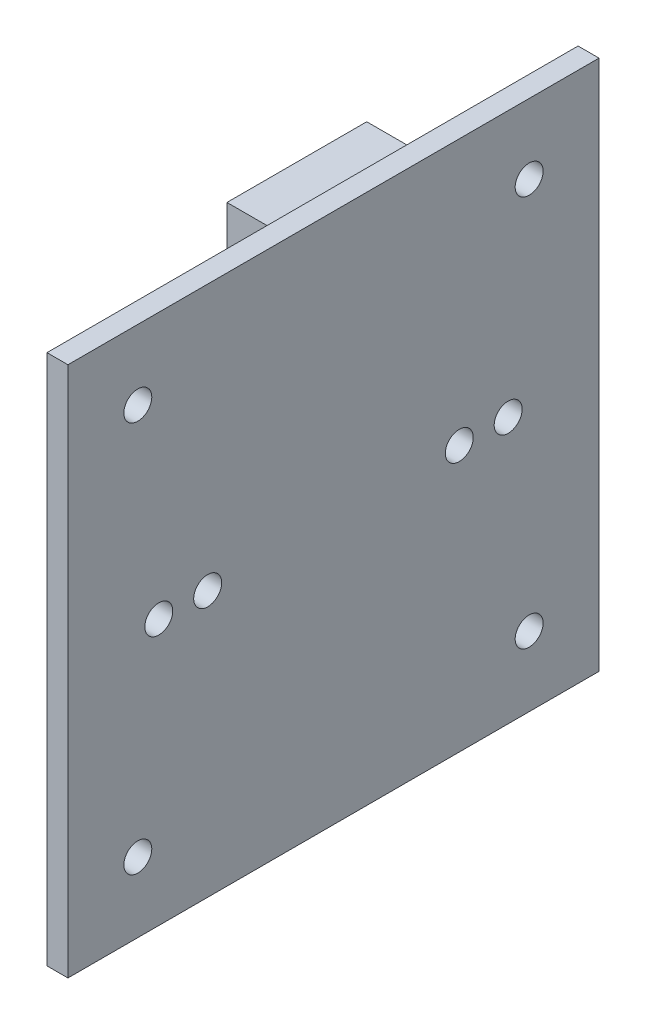
ISO-10303-21;
HEADER;
FILE_DESCRIPTION(('STEP AP214'),'2;1');
FILE_NAME('part.step','',(''),(''),'','','');
FILE_SCHEMA(('AUTOMOTIVE_DESIGN { 1 0 10303 214 1 1 1 1 }'));
ENDSEC;
DATA;
#1=APPLICATION_CONTEXT('core data for automotive mechanical design processes');
#2=APPLICATION_PROTOCOL_DEFINITION('international standard','automotive_design',2000,#1);
#3=PRODUCT_CONTEXT('',#1,'mechanical');
#4=PRODUCT('Part','Part','',(#3));
#5=PRODUCT_RELATED_PRODUCT_CATEGORY('part','',(#4));
#6=PRODUCT_DEFINITION_FORMATION('','',#4);
#7=PRODUCT_DEFINITION_CONTEXT('part definition',#1,'design');
#8=PRODUCT_DEFINITION('design','',#6,#7);
#9=PRODUCT_DEFINITION_SHAPE('','',#8);
#10=(LENGTH_UNIT() NAMED_UNIT(*) SI_UNIT(.MILLI.,.METRE.));
#11=(NAMED_UNIT(*) PLANE_ANGLE_UNIT() SI_UNIT($,.RADIAN.));
#12=(NAMED_UNIT(*) SI_UNIT($,.STERADIAN.) SOLID_ANGLE_UNIT());
#13=UNCERTAINTY_MEASURE_WITH_UNIT(LENGTH_MEASURE(1.E-05),#10,'distance_accuracy_value','');
#14=(GEOMETRIC_REPRESENTATION_CONTEXT(3) GLOBAL_UNCERTAINTY_ASSIGNED_CONTEXT((#13)) GLOBAL_UNIT_ASSIGNED_CONTEXT((#10,
#11,#12)) REPRESENTATION_CONTEXT('',''));
#15=CARTESIAN_POINT('',(0.,0.,0.));
#16=DIRECTION('',(0.,0.,1.));
#17=DIRECTION('',(1.,0.,0.));
#18=AXIS2_PLACEMENT_3D('',#15,#16,#17);
#19=CARTESIAN_POINT('',(0.,0.,0.));
#20=DIRECTION('',(-1.,0.,0.));
#21=DIRECTION('',(0.,0.,1.));
#22=AXIS2_PLACEMENT_3D('',#19,#20,#21);
#23=PLANE('',#22);
#24=CARTESIAN_POINT('',(0.,0.,9.));
#25=DIRECTION('',(-1.,0.,0.));
#26=DIRECTION('',(0.,0.,1.));
#27=AXIS2_PLACEMENT_3D('',#24,#25,#26);
#28=CIRCLE('',#27,1.);
#29=CARTESIAN_POINT('',(0.,0.,10.));
#30=VERTEX_POINT('',#29);
#31=EDGE_CURVE('E157',#30,#30,#28,.T.);
#32=ORIENTED_EDGE('',*,*,#31,.F.);
#33=EDGE_LOOP('',(#32));
#34=FACE_BOUND('',#33,.T.);
#35=CARTESIAN_POINT('',(0.,0.,-9.));
#36=DIRECTION('',(-1.,0.,0.));
#37=DIRECTION('',(0.,0.,1.));
#38=AXIS2_PLACEMENT_3D('',#35,#36,#37);
#39=CIRCLE('',#38,1.);
#40=CARTESIAN_POINT('',(0.,0.,-8.));
#41=VERTEX_POINT('',#40);
#42=EDGE_CURVE('E545',#41,#41,#39,.T.);
#43=ORIENTED_EDGE('',*,*,#42,.F.);
#44=EDGE_LOOP('',(#43));
#45=FACE_BOUND('',#44,.T.);
#46=CARTESIAN_POINT('',(0.,-14.,14.));
#47=DIRECTION('',(1.,0.,0.));
#48=DIRECTION('',(0.,0.,-1.));
#49=AXIS2_PLACEMENT_3D('',#46,#47,#48);
#50=CIRCLE('',#49,0.999999999999999);
#51=CARTESIAN_POINT('',(0.,-14.,13.));
#52=VERTEX_POINT('',#51);
#53=EDGE_CURVE('E229',#52,#52,#50,.T.);
#54=ORIENTED_EDGE('',*,*,#53,.T.);
#55=EDGE_LOOP('',(#54));
#56=FACE_BOUND('',#55,.T.);
#57=CARTESIAN_POINT('',(0.,-14.,-14.));
#58=DIRECTION('',(1.,0.,0.));
#59=DIRECTION('',(0.,0.,-1.));
#60=AXIS2_PLACEMENT_3D('',#57,#58,#59);
#61=CIRCLE('',#60,0.999999999999999);
#62=CARTESIAN_POINT('',(0.,-14.,-15.));
#63=VERTEX_POINT('',#62);
#64=EDGE_CURVE('E238',#63,#63,#61,.T.);
#65=ORIENTED_EDGE('',*,*,#64,.T.);
#66=EDGE_LOOP('',(#65));
#67=FACE_BOUND('',#66,.T.);
#68=CARTESIAN_POINT('',(0.,14.,-14.));
#69=DIRECTION('',(1.,0.,0.));
#70=DIRECTION('',(0.,0.,-1.));
#71=AXIS2_PLACEMENT_3D('',#68,#69,#70);
#72=CIRCLE('',#71,0.999999999999999);
#73=CARTESIAN_POINT('',(0.,14.,-15.));
#74=VERTEX_POINT('',#73);
#75=EDGE_CURVE('E246',#74,#74,#72,.T.);
#76=ORIENTED_EDGE('',*,*,#75,.T.);
#77=EDGE_LOOP('',(#76));
#78=FACE_BOUND('',#77,.T.);
#79=CARTESIAN_POINT('',(0.,0.,12.5));
#80=DIRECTION('',(1.,0.,0.));
#81=DIRECTION('',(0.,0.,-1.));
#82=AXIS2_PLACEMENT_3D('',#79,#80,#81);
#83=CIRCLE('',#82,1.);
#84=CARTESIAN_POINT('',(0.,0.,11.5));
#85=VERTEX_POINT('',#84);
#86=EDGE_CURVE('E254',#85,#85,#83,.T.);
#87=ORIENTED_EDGE('',*,*,#86,.T.);
#88=EDGE_LOOP('',(#87));
#89=FACE_BOUND('',#88,.T.);
#90=CARTESIAN_POINT('',(0.,0.,-12.5));
#91=DIRECTION('',(1.,0.,0.));
#92=DIRECTION('',(0.,0.,-1.));
#93=AXIS2_PLACEMENT_3D('',#90,#91,#92);
#94=CIRCLE('',#93,1.);
#95=CARTESIAN_POINT('',(0.,0.,-13.5));
#96=VERTEX_POINT('',#95);
#97=EDGE_CURVE('E221',#96,#96,#94,.T.);
#98=ORIENTED_EDGE('',*,*,#97,.T.);
#99=EDGE_LOOP('',(#98));
#100=FACE_BOUND('',#99,.T.);
#101=CARTESIAN_POINT('',(0.,14.,14.));
#102=DIRECTION('',(1.,0.,0.));
#103=DIRECTION('',(0.,0.,-1.));
#104=AXIS2_PLACEMENT_3D('',#101,#102,#103);
#105=CIRCLE('',#104,0.999999999999999);
#106=CARTESIAN_POINT('',(0.,14.,13.));
#107=VERTEX_POINT('',#106);
#108=EDGE_CURVE('E261',#107,#107,#105,.T.);
#109=ORIENTED_EDGE('',*,*,#108,.T.);
#110=EDGE_LOOP('',(#109));
#111=FACE_BOUND('',#110,.T.);
#112=DIRECTION('',(0.,0.,-1.));
#113=VECTOR('',#112,1.);
#114=CARTESIAN_POINT('',(0.,-19.,19.));
#115=LINE('',#114,#113);
#116=CARTESIAN_POINT('',(0.,-19.,19.));
#117=VERTEX_POINT('',#116);
#118=CARTESIAN_POINT('',(0.,-19.,-19.));
#119=VERTEX_POINT('',#118);
#120=EDGE_CURVE('E265',#117,#119,#115,.T.);
#121=ORIENTED_EDGE('',*,*,#120,.F.);
#122=DIRECTION('',(0.,-1.,0.));
#123=VECTOR('',#122,1.);
#124=CARTESIAN_POINT('',(0.,19.,19.));
#125=LINE('',#124,#123);
#126=CARTESIAN_POINT('',(0.,19.,19.));
#127=VERTEX_POINT('',#126);
#128=EDGE_CURVE('E273',#127,#117,#125,.T.);
#129=ORIENTED_EDGE('',*,*,#128,.F.);
#130=DIRECTION('',(0.,0.,-1.));
#131=VECTOR('',#130,1.);
#132=CARTESIAN_POINT('',(0.,19.,19.));
#133=LINE('',#132,#131);
#134=CARTESIAN_POINT('',(0.,19.,-19.));
#135=VERTEX_POINT('',#134);
#136=EDGE_CURVE('E292',#127,#135,#133,.T.);
#137=ORIENTED_EDGE('',*,*,#136,.T.);
#138=DIRECTION('',(0.,-1.,0.));
#139=VECTOR('',#138,1.);
#140=CARTESIAN_POINT('',(0.,19.,-19.));
#141=LINE('',#140,#139);
#142=EDGE_CURVE('E288',#135,#119,#141,.T.);
#143=ORIENTED_EDGE('',*,*,#142,.T.);
#144=EDGE_LOOP('',(#121,#129,#137,#143));
#145=FACE_BOUND('',#144,.T.);
#146=DIRECTION('',(0.,-1.,0.));
#147=VECTOR('',#146,1.);
#148=CARTESIAN_POINT('',(0.,14.8675526556487,-0.878697065108815));
#149=LINE('',#148,#147);
#150=CARTESIAN_POINT('',(0.,14.8675526556487,-0.878697065108815));
#151=VERTEX_POINT('',#150);
#152=CARTESIAN_POINT('',(0.,10.8675526556487,-0.878697065108815));
#153=VERTEX_POINT('',#152);
#154=EDGE_CURVE('E200',#151,#153,#149,.T.);
#155=ORIENTED_EDGE('',*,*,#154,.T.);
#156=DIRECTION('',(0.,0.,1.));
#157=VECTOR('',#156,1.);
#158=CARTESIAN_POINT('',(0.,10.8675526556487,-10.8786970651088));
#159=LINE('',#158,#157);
#160=CARTESIAN_POINT('',(0.,10.8675526556487,-10.8786970651088));
#161=VERTEX_POINT('',#160);
#162=EDGE_CURVE('E175',#161,#153,#159,.T.);
#163=ORIENTED_EDGE('',*,*,#162,.F.);
#164=DIRECTION('',(0.,-1.,0.));
#165=VECTOR('',#164,1.);
#166=CARTESIAN_POINT('',(0.,14.8675526556487,-10.8786970651088));
#167=LINE('',#166,#165);
#168=CARTESIAN_POINT('',(0.,14.8675526556487,-10.8786970651088));
#169=VERTEX_POINT('',#168);
#170=EDGE_CURVE('E185',#169,#161,#167,.T.);
#171=ORIENTED_EDGE('',*,*,#170,.F.);
#172=DIRECTION('',(0.,0.,1.));
#173=VECTOR('',#172,1.);
#174=CARTESIAN_POINT('',(0.,14.8675526556487,-10.8786970651088));
#175=LINE('',#174,#173);
#176=EDGE_CURVE('E62',#169,#151,#175,.T.);
#177=ORIENTED_EDGE('',*,*,#176,.T.);
#178=EDGE_LOOP('',(#155,#163,#171,#177));
#179=FACE_BOUND('',#178,.T.);
#180=ADVANCED_FACE('F38',(#34,#45,#56,#67,#78,#89,#100,#111,#145,#179),#23,.T.);
#181=CARTESIAN_POINT('',(1.5,-19.,19.));
#182=DIRECTION('',(0.,1.,0.));
#183=DIRECTION('',(0.,0.,1.));
#184=AXIS2_PLACEMENT_3D('',#181,#182,#183);
#185=PLANE('',#184);
#186=ORIENTED_EDGE('',*,*,#120,.T.);
#187=DIRECTION('',(-1.,0.,0.));
#188=VECTOR('',#187,1.);
#189=CARTESIAN_POINT('',(1.5,-19.,-19.));
#190=LINE('',#189,#188);
#191=CARTESIAN_POINT('',(1.5,-19.,-19.));
#192=VERTEX_POINT('',#191);
#193=EDGE_CURVE('E11',#192,#119,#190,.T.);
#194=ORIENTED_EDGE('',*,*,#193,.F.);
#195=DIRECTION('',(0.,0.,-1.));
#196=VECTOR('',#195,1.);
#197=CARTESIAN_POINT('',(1.5,-19.,19.));
#198=LINE('',#197,#196);
#199=CARTESIAN_POINT('',(1.5,-19.,19.));
#200=VERTEX_POINT('',#199);
#201=EDGE_CURVE('E269',#200,#192,#198,.T.);
#202=ORIENTED_EDGE('',*,*,#201,.F.);
#203=DIRECTION('',(-1.,0.,0.));
#204=VECTOR('',#203,1.);
#205=CARTESIAN_POINT('',(1.5,-19.,19.));
#206=LINE('',#205,#204);
#207=EDGE_CURVE('E284',#200,#117,#206,.T.);
#208=ORIENTED_EDGE('',*,*,#207,.T.);
#209=EDGE_LOOP('',(#186,#194,#202,#208));
#210=FACE_BOUND('',#209,.T.);
#211=ADVANCED_FACE('F40',(#210),#185,.F.);
#212=CARTESIAN_POINT('',(1.5,19.,-19.));
#213=DIRECTION('',(0.,0.,-1.));
#214=DIRECTION('',(0.,1.,0.));
#215=AXIS2_PLACEMENT_3D('',#212,#213,#214);
#216=PLANE('',#215);
#217=ORIENTED_EDGE('',*,*,#142,.F.);
#218=DIRECTION('',(-1.,0.,0.));
#219=VECTOR('',#218,1.);
#220=CARTESIAN_POINT('',(1.5,19.,-19.));
#221=LINE('',#220,#219);
#222=CARTESIAN_POINT('',(1.5,19.,-19.));
#223=VERTEX_POINT('',#222);
#224=EDGE_CURVE('E47',#223,#135,#221,.T.);
#225=ORIENTED_EDGE('',*,*,#224,.F.);
#226=DIRECTION('',(0.,-1.,0.));
#227=VECTOR('',#226,1.);
#228=CARTESIAN_POINT('',(1.5,19.,-19.));
#229=LINE('',#228,#227);
#230=EDGE_CURVE('E272',#223,#192,#229,.T.);
#231=ORIENTED_EDGE('',*,*,#230,.T.);
#232=ORIENTED_EDGE('',*,*,#193,.T.);
#233=EDGE_LOOP('',(#217,#225,#231,#232));
#234=FACE_BOUND('',#233,.T.);
#235=ADVANCED_FACE('F311',(#234),#216,.T.);
#236=CARTESIAN_POINT('',(1.5,19.,19.));
#237=DIRECTION('',(0.,1.,0.));
#238=DIRECTION('',(0.,0.,1.));
#239=AXIS2_PLACEMENT_3D('',#236,#237,#238);
#240=PLANE('',#239);
#241=ORIENTED_EDGE('',*,*,#136,.F.);
#242=DIRECTION('',(-1.,0.,0.));
#243=VECTOR('',#242,1.);
#244=CARTESIAN_POINT('',(1.5,19.,19.));
#245=LINE('',#244,#243);
#246=CARTESIAN_POINT('',(1.5,19.,19.));
#247=VERTEX_POINT('',#246);
#248=EDGE_CURVE('E301',#247,#127,#245,.T.);
#249=ORIENTED_EDGE('',*,*,#248,.F.);
#250=DIRECTION('',(0.,0.,-1.));
#251=VECTOR('',#250,1.);
#252=CARTESIAN_POINT('',(1.5,19.,19.));
#253=LINE('',#252,#251);
#254=EDGE_CURVE('E277',#247,#223,#253,.T.);
#255=ORIENTED_EDGE('',*,*,#254,.T.);
#256=ORIENTED_EDGE('',*,*,#224,.T.);
#257=EDGE_LOOP('',(#241,#249,#255,#256));
#258=FACE_BOUND('',#257,.T.);
#259=ADVANCED_FACE('F307',(#258),#240,.T.);
#260=CARTESIAN_POINT('',(1.5,19.,19.));
#261=DIRECTION('',(0.,0.,-1.));
#262=DIRECTION('',(0.,1.,0.));
#263=AXIS2_PLACEMENT_3D('',#260,#261,#262);
#264=PLANE('',#263);
#265=ORIENTED_EDGE('',*,*,#128,.T.);
#266=ORIENTED_EDGE('',*,*,#207,.F.);
#267=DIRECTION('',(0.,-1.,0.));
#268=VECTOR('',#267,1.);
#269=CARTESIAN_POINT('',(1.5,19.,19.));
#270=LINE('',#269,#268);
#271=EDGE_CURVE('E281',#247,#200,#270,.T.);
#272=ORIENTED_EDGE('',*,*,#271,.F.);
#273=ORIENTED_EDGE('',*,*,#248,.T.);
#274=EDGE_LOOP('',(#265,#266,#272,#273));
#275=FACE_BOUND('',#274,.T.);
#276=ADVANCED_FACE('F319',(#275),#264,.F.);
#277=CARTESIAN_POINT('',(1.5,0.,0.));
#278=DIRECTION('',(-1.,0.,0.));
#279=DIRECTION('',(0.,0.,1.));
#280=AXIS2_PLACEMENT_3D('',#277,#278,#279);
#281=PLANE('',#280);
#282=CARTESIAN_POINT('',(1.5,0.,9.));
#283=DIRECTION('',(1.,0.,0.));
#284=DIRECTION('',(0.,0.,-1.));
#285=AXIS2_PLACEMENT_3D('',#282,#283,#284);
#286=CIRCLE('',#285,1.);
#287=CARTESIAN_POINT('',(1.5,0.,8.));
#288=VERTEX_POINT('',#287);
#289=EDGE_CURVE('E543',#288,#288,#286,.T.);
#290=ORIENTED_EDGE('',*,*,#289,.F.);
#291=EDGE_LOOP('',(#290));
#292=FACE_BOUND('',#291,.T.);
#293=CARTESIAN_POINT('',(1.5,0.,-9.));
#294=DIRECTION('',(1.,0.,0.));
#295=DIRECTION('',(0.,0.,-1.));
#296=AXIS2_PLACEMENT_3D('',#293,#294,#295);
#297=CIRCLE('',#296,1.);
#298=CARTESIAN_POINT('',(1.5,0.,-10.));
#299=VERTEX_POINT('',#298);
#300=EDGE_CURVE('E546',#299,#299,#297,.T.);
#301=ORIENTED_EDGE('',*,*,#300,.F.);
#302=EDGE_LOOP('',(#301));
#303=FACE_BOUND('',#302,.T.);
#304=CARTESIAN_POINT('',(1.5,-14.,14.));
#305=DIRECTION('',(1.,0.,0.));
#306=DIRECTION('',(0.,0.,-1.));
#307=AXIS2_PLACEMENT_3D('',#304,#305,#306);
#308=CIRCLE('',#307,0.999999999999999);
#309=CARTESIAN_POINT('',(1.5,-14.,13.));
#310=VERTEX_POINT('',#309);
#311=EDGE_CURVE('E234',#310,#310,#308,.T.);
#312=ORIENTED_EDGE('',*,*,#311,.F.);
#313=EDGE_LOOP('',(#312));
#314=FACE_BOUND('',#313,.T.);
#315=CARTESIAN_POINT('',(1.5,-14.,-14.));
#316=DIRECTION('',(1.,0.,0.));
#317=DIRECTION('',(0.,0.,-1.));
#318=AXIS2_PLACEMENT_3D('',#315,#316,#317);
#319=CIRCLE('',#318,0.999999999999999);
#320=CARTESIAN_POINT('',(1.5,-14.,-15.));
#321=VERTEX_POINT('',#320);
#322=EDGE_CURVE('E242',#321,#321,#319,.T.);
#323=ORIENTED_EDGE('',*,*,#322,.F.);
#324=EDGE_LOOP('',(#323));
#325=FACE_BOUND('',#324,.T.);
#326=CARTESIAN_POINT('',(1.5,14.,-14.));
#327=DIRECTION('',(1.,0.,0.));
#328=DIRECTION('',(0.,0.,-1.));
#329=AXIS2_PLACEMENT_3D('',#326,#327,#328);
#330=CIRCLE('',#329,0.999999999999999);
#331=CARTESIAN_POINT('',(1.5,14.,-15.));
#332=VERTEX_POINT('',#331);
#333=EDGE_CURVE('E250',#332,#332,#330,.T.);
#334=ORIENTED_EDGE('',*,*,#333,.F.);
#335=EDGE_LOOP('',(#334));
#336=FACE_BOUND('',#335,.T.);
#337=CARTESIAN_POINT('',(1.5,0.,12.5));
#338=DIRECTION('',(1.,0.,0.));
#339=DIRECTION('',(0.,0.,-1.));
#340=AXIS2_PLACEMENT_3D('',#337,#338,#339);
#341=CIRCLE('',#340,1.);
#342=CARTESIAN_POINT('',(1.5,0.,11.5));
#343=VERTEX_POINT('',#342);
#344=EDGE_CURVE('E225',#343,#343,#341,.T.);
#345=ORIENTED_EDGE('',*,*,#344,.F.);
#346=EDGE_LOOP('',(#345));
#347=FACE_BOUND('',#346,.T.);
#348=CARTESIAN_POINT('',(1.5,0.,-12.5));
#349=DIRECTION('',(1.,0.,0.));
#350=DIRECTION('',(0.,0.,-1.));
#351=AXIS2_PLACEMENT_3D('',#348,#349,#350);
#352=CIRCLE('',#351,1.);
#353=CARTESIAN_POINT('',(1.5,0.,-13.5));
#354=VERTEX_POINT('',#353);
#355=EDGE_CURVE('E220',#354,#354,#352,.T.);
#356=ORIENTED_EDGE('',*,*,#355,.F.);
#357=EDGE_LOOP('',(#356));
#358=FACE_BOUND('',#357,.T.);
#359=CARTESIAN_POINT('',(1.5,14.,14.));
#360=DIRECTION('',(1.,0.,0.));
#361=DIRECTION('',(0.,0.,-1.));
#362=AXIS2_PLACEMENT_3D('',#359,#360,#361);
#363=CIRCLE('',#362,0.999999999999999);
#364=CARTESIAN_POINT('',(1.5,14.,13.));
#365=VERTEX_POINT('',#364);
#366=EDGE_CURVE('E233',#365,#365,#363,.T.);
#367=ORIENTED_EDGE('',*,*,#366,.F.);
#368=EDGE_LOOP('',(#367));
#369=FACE_BOUND('',#368,.T.);
#370=ORIENTED_EDGE('',*,*,#201,.T.);
#371=ORIENTED_EDGE('',*,*,#230,.F.);
#372=ORIENTED_EDGE('',*,*,#254,.F.);
#373=ORIENTED_EDGE('',*,*,#271,.T.);
#374=EDGE_LOOP('',(#370,#371,#372,#373));
#375=FACE_BOUND('',#374,.T.);
#376=ADVANCED_FACE('F324',(#292,#303,#314,#325,#336,#347,#358,#369,#375),#281,.F.);
#377=CARTESIAN_POINT('',(0.,14.,14.));
#378=DIRECTION('',(1.,0.,0.));
#379=DIRECTION('',(0.,0.,-1.));
#380=AXIS2_PLACEMENT_3D('',#377,#378,#379);
#381=CYLINDRICAL_SURFACE('',#380,0.999999999999999);
#382=ORIENTED_EDGE('',*,*,#108,.F.);
#383=EDGE_LOOP('',(#382));
#384=FACE_BOUND('',#383,.T.);
#385=ORIENTED_EDGE('',*,*,#366,.T.);
#386=EDGE_LOOP('',(#385));
#387=FACE_BOUND('',#386,.T.);
#388=ADVANCED_FACE('F326',(#384,#387),#381,.F.);
#389=CARTESIAN_POINT('',(0.,0.,-12.5));
#390=DIRECTION('',(1.,0.,0.));
#391=DIRECTION('',(0.,0.,-1.));
#392=AXIS2_PLACEMENT_3D('',#389,#390,#391);
#393=CYLINDRICAL_SURFACE('',#392,1.);
#394=ORIENTED_EDGE('',*,*,#97,.F.);
#395=EDGE_LOOP('',(#394));
#396=FACE_BOUND('',#395,.T.);
#397=ORIENTED_EDGE('',*,*,#355,.T.);
#398=EDGE_LOOP('',(#397));
#399=FACE_BOUND('',#398,.T.);
#400=ADVANCED_FACE('F334',(#396,#399),#393,.F.);
#401=CARTESIAN_POINT('',(0.,0.,12.5));
#402=DIRECTION('',(1.,0.,0.));
#403=DIRECTION('',(0.,0.,-1.));
#404=AXIS2_PLACEMENT_3D('',#401,#402,#403);
#405=CYLINDRICAL_SURFACE('',#404,1.);
#406=ORIENTED_EDGE('',*,*,#86,.F.);
#407=EDGE_LOOP('',(#406));
#408=FACE_BOUND('',#407,.T.);
#409=ORIENTED_EDGE('',*,*,#344,.T.);
#410=EDGE_LOOP('',(#409));
#411=FACE_BOUND('',#410,.T.);
#412=ADVANCED_FACE('F378',(#408,#411),#405,.F.);
#413=CARTESIAN_POINT('',(0.,14.,-14.));
#414=DIRECTION('',(1.,0.,0.));
#415=DIRECTION('',(0.,0.,-1.));
#416=AXIS2_PLACEMENT_3D('',#413,#414,#415);
#417=CYLINDRICAL_SURFACE('',#416,0.999999999999999);
#418=ORIENTED_EDGE('',*,*,#75,.F.);
#419=EDGE_LOOP('',(#418));
#420=FACE_BOUND('',#419,.T.);
#421=ORIENTED_EDGE('',*,*,#333,.T.);
#422=EDGE_LOOP('',(#421));
#423=FACE_BOUND('',#422,.T.);
#424=ADVANCED_FACE('F386',(#420,#423),#417,.F.);
#425=CARTESIAN_POINT('',(0.,-14.,-14.));
#426=DIRECTION('',(1.,0.,0.));
#427=DIRECTION('',(0.,0.,-1.));
#428=AXIS2_PLACEMENT_3D('',#425,#426,#427);
#429=CYLINDRICAL_SURFACE('',#428,0.999999999999999);
#430=ORIENTED_EDGE('',*,*,#64,.F.);
#431=EDGE_LOOP('',(#430));
#432=FACE_BOUND('',#431,.T.);
#433=ORIENTED_EDGE('',*,*,#322,.T.);
#434=EDGE_LOOP('',(#433));
#435=FACE_BOUND('',#434,.T.);
#436=ADVANCED_FACE('F394',(#432,#435),#429,.F.);
#437=CARTESIAN_POINT('',(0.,-14.,14.));
#438=DIRECTION('',(1.,0.,0.));
#439=DIRECTION('',(0.,0.,-1.));
#440=AXIS2_PLACEMENT_3D('',#437,#438,#439);
#441=CYLINDRICAL_SURFACE('',#440,0.999999999999999);
#442=ORIENTED_EDGE('',*,*,#53,.F.);
#443=EDGE_LOOP('',(#442));
#444=FACE_BOUND('',#443,.T.);
#445=ORIENTED_EDGE('',*,*,#311,.T.);
#446=EDGE_LOOP('',(#445));
#447=FACE_BOUND('',#446,.T.);
#448=ADVANCED_FACE('F402',(#444,#447),#441,.F.);
#449=CARTESIAN_POINT('',(-7.,10.8675526556487,-10.8786970651088));
#450=DIRECTION('',(0.,1.,0.));
#451=DIRECTION('',(0.,0.,1.));
#452=AXIS2_PLACEMENT_3D('',#449,#450,#451);
#453=PLANE('',#452);
#454=ORIENTED_EDGE('',*,*,#162,.T.);
#455=DIRECTION('',(1.,0.,0.));
#456=VECTOR('',#455,1.);
#457=CARTESIAN_POINT('',(-7.,10.8675526556487,-0.878697065108815));
#458=LINE('',#457,#456);
#459=CARTESIAN_POINT('',(-7.,10.8675526556487,-0.878697065108815));
#460=VERTEX_POINT('',#459);
#461=EDGE_CURVE('E217',#460,#153,#458,.T.);
#462=ORIENTED_EDGE('',*,*,#461,.F.);
#463=DIRECTION('',(0.,0.,1.));
#464=VECTOR('',#463,1.);
#465=CARTESIAN_POINT('',(-7.,10.8675526556487,-10.8786970651088));
#466=LINE('',#465,#464);
#467=CARTESIAN_POINT('',(-7.,10.8675526556487,-10.8786970651088));
#468=VERTEX_POINT('',#467);
#469=EDGE_CURVE('E181',#468,#460,#466,.T.);
#470=ORIENTED_EDGE('',*,*,#469,.F.);
#471=DIRECTION('',(1.,0.,0.));
#472=VECTOR('',#471,1.);
#473=CARTESIAN_POINT('',(-7.,10.8675526556487,-10.8786970651088));
#474=LINE('',#473,#472);
#475=EDGE_CURVE('E196',#468,#161,#474,.T.);
#476=ORIENTED_EDGE('',*,*,#475,.T.);
#477=EDGE_LOOP('',(#454,#462,#470,#476));
#478=FACE_BOUND('',#477,.T.);
#479=ADVANCED_FACE('F410',(#478),#453,.F.);
#480=CARTESIAN_POINT('',(-7.,14.8675526556487,-0.878697065108815));
#481=DIRECTION('',(0.,0.,1.));
#482=DIRECTION('',(1.,0.,0.));
#483=AXIS2_PLACEMENT_3D('',#480,#481,#482);
#484=PLANE('',#483);
#485=ORIENTED_EDGE('',*,*,#154,.F.);
#486=DIRECTION('',(1.,0.,0.));
#487=VECTOR('',#486,1.);
#488=CARTESIAN_POINT('',(-7.,14.8675526556487,-0.878697065108815));
#489=LINE('',#488,#487);
#490=CARTESIAN_POINT('',(-7.,14.8675526556487,-0.878697065108815));
#491=VERTEX_POINT('',#490);
#492=EDGE_CURVE('E214',#491,#151,#489,.T.);
#493=ORIENTED_EDGE('',*,*,#492,.F.);
#494=DIRECTION('',(0.,-1.,0.));
#495=VECTOR('',#494,1.);
#496=CARTESIAN_POINT('',(-7.,14.8675526556487,-0.878697065108815));
#497=LINE('',#496,#495);
#498=EDGE_CURVE('E184',#491,#460,#497,.T.);
#499=ORIENTED_EDGE('',*,*,#498,.T.);
#500=ORIENTED_EDGE('',*,*,#461,.T.);
#501=EDGE_LOOP('',(#485,#493,#499,#500));
#502=FACE_BOUND('',#501,.T.);
#503=ADVANCED_FACE('F418',(#502),#484,.T.);
#504=CARTESIAN_POINT('',(-7.,14.8675526556487,-10.8786970651088));
#505=DIRECTION('',(0.,1.,0.));
#506=DIRECTION('',(0.,0.,1.));
#507=AXIS2_PLACEMENT_3D('',#504,#505,#506);
#508=PLANE('',#507);
#509=ORIENTED_EDGE('',*,*,#176,.F.);
#510=DIRECTION('',(1.,0.,0.));
#511=VECTOR('',#510,1.);
#512=CARTESIAN_POINT('',(-7.,14.8675526556487,-10.8786970651088));
#513=LINE('',#512,#511);
#514=CARTESIAN_POINT('',(-7.,14.8675526556487,-10.8786970651088));
#515=VERTEX_POINT('',#514);
#516=EDGE_CURVE('E211',#515,#169,#513,.T.);
#517=ORIENTED_EDGE('',*,*,#516,.F.);
#518=DIRECTION('',(0.,0.,1.));
#519=VECTOR('',#518,1.);
#520=CARTESIAN_POINT('',(-7.,14.8675526556487,-10.8786970651088));
#521=LINE('',#520,#519);
#522=EDGE_CURVE('E189',#515,#491,#521,.T.);
#523=ORIENTED_EDGE('',*,*,#522,.T.);
#524=ORIENTED_EDGE('',*,*,#492,.T.);
#525=EDGE_LOOP('',(#509,#517,#523,#524));
#526=FACE_BOUND('',#525,.T.);
#527=ADVANCED_FACE('F426',(#526),#508,.T.);
#528=CARTESIAN_POINT('',(-7.,14.8675526556487,-10.8786970651088));
#529=DIRECTION('',(0.,0.,1.));
#530=DIRECTION('',(1.,0.,0.));
#531=AXIS2_PLACEMENT_3D('',#528,#529,#530);
#532=PLANE('',#531);
#533=ORIENTED_EDGE('',*,*,#170,.T.);
#534=ORIENTED_EDGE('',*,*,#475,.F.);
#535=DIRECTION('',(0.,-1.,0.));
#536=VECTOR('',#535,1.);
#537=CARTESIAN_POINT('',(-7.,14.8675526556487,-10.8786970651088));
#538=LINE('',#537,#536);
#539=EDGE_CURVE('E193',#515,#468,#538,.T.);
#540=ORIENTED_EDGE('',*,*,#539,.F.);
#541=ORIENTED_EDGE('',*,*,#516,.T.);
#542=EDGE_LOOP('',(#533,#534,#540,#541));
#543=FACE_BOUND('',#542,.T.);
#544=ADVANCED_FACE('F434',(#543),#532,.F.);
#545=CARTESIAN_POINT('',(-7.,0.,0.));
#546=DIRECTION('',(1.,0.,0.));
#547=DIRECTION('',(0.,0.,-1.));
#548=AXIS2_PLACEMENT_3D('',#545,#546,#547);
#549=PLANE('',#548);
#550=DIRECTION('',(0.,-1.,0.));
#551=VECTOR('',#550,1.);
#552=CARTESIAN_POINT('',(-7.,14.6175526556487,-1.12869706510881));
#553=LINE('',#552,#551);
#554=CARTESIAN_POINT('',(-7.,14.6175526556487,-1.12869706510881));
#555=VERTEX_POINT('',#554);
#556=CARTESIAN_POINT('',(-7.,11.1175526556487,-1.12869706510881));
#557=VERTEX_POINT('',#556);
#558=EDGE_CURVE('E166',#555,#557,#553,.T.);
#559=ORIENTED_EDGE('',*,*,#558,.T.);
#560=DIRECTION('',(0.,0.,1.));
#561=VECTOR('',#560,1.);
#562=CARTESIAN_POINT('',(-7.,11.1175526556487,-10.6286970651088));
#563=LINE('',#562,#561);
#564=CARTESIAN_POINT('',(-7.,11.1175526556487,-10.6286970651088));
#565=VERTEX_POINT('',#564);
#566=EDGE_CURVE('E54',#565,#557,#563,.T.);
#567=ORIENTED_EDGE('',*,*,#566,.F.);
#568=DIRECTION('',(0.,-1.,0.));
#569=VECTOR('',#568,1.);
#570=CARTESIAN_POINT('',(-7.,14.6175526556487,-10.6286970651088));
#571=LINE('',#570,#569);
#572=CARTESIAN_POINT('',(-7.,14.6175526556487,-10.6286970651088));
#573=VERTEX_POINT('',#572);
#574=EDGE_CURVE('E150',#573,#565,#571,.T.);
#575=ORIENTED_EDGE('',*,*,#574,.F.);
#576=DIRECTION('',(0.,0.,1.));
#577=VECTOR('',#576,1.);
#578=CARTESIAN_POINT('',(-7.,14.6175526556487,-10.6286970651088));
#579=LINE('',#578,#577);
#580=EDGE_CURVE('E154',#573,#555,#579,.T.);
#581=ORIENTED_EDGE('',*,*,#580,.T.);
#582=EDGE_LOOP('',(#559,#567,#575,#581));
#583=FACE_BOUND('',#582,.T.);
#584=ORIENTED_EDGE('',*,*,#469,.T.);
#585=ORIENTED_EDGE('',*,*,#498,.F.);
#586=ORIENTED_EDGE('',*,*,#522,.F.);
#587=ORIENTED_EDGE('',*,*,#539,.T.);
#588=EDGE_LOOP('',(#584,#585,#586,#587));
#589=FACE_BOUND('',#588,.T.);
#590=ADVANCED_FACE('F441',(#583,#589),#549,.F.);
#591=CARTESIAN_POINT('',(-2.,11.1175526556487,-10.6286970651088));
#592=DIRECTION('',(0.,-1.,0.));
#593=DIRECTION('',(0.,0.,-1.));
#594=AXIS2_PLACEMENT_3D('',#591,#592,#593);
#595=PLANE('',#594);
#596=ORIENTED_EDGE('',*,*,#566,.T.);
#597=DIRECTION('',(-1.,0.,0.));
#598=VECTOR('',#597,1.);
#599=CARTESIAN_POINT('',(-2.,11.1175526556487,-1.12869706510881));
#600=LINE('',#599,#598);
#601=CARTESIAN_POINT('',(-2.,11.1175526556487,-1.12869706510881));
#602=VERTEX_POINT('',#601);
#603=EDGE_CURVE('E131',#602,#557,#600,.T.);
#604=ORIENTED_EDGE('',*,*,#603,.F.);
#605=DIRECTION('',(0.,0.,1.));
#606=VECTOR('',#605,1.);
#607=CARTESIAN_POINT('',(-2.,11.1175526556487,-10.6286970651088));
#608=LINE('',#607,#606);
#609=CARTESIAN_POINT('',(-2.,11.1175526556487,-10.6286970651088));
#610=VERTEX_POINT('',#609);
#611=EDGE_CURVE('E139',#610,#602,#608,.T.);
#612=ORIENTED_EDGE('',*,*,#611,.F.);
#613=DIRECTION('',(-1.,0.,0.));
#614=VECTOR('',#613,1.);
#615=CARTESIAN_POINT('',(-2.,11.1175526556487,-10.6286970651088));
#616=LINE('',#615,#614);
#617=EDGE_CURVE('E172',#610,#565,#616,.T.);
#618=ORIENTED_EDGE('',*,*,#617,.T.);
#619=EDGE_LOOP('',(#596,#604,#612,#618));
#620=FACE_BOUND('',#619,.T.);
#621=ADVANCED_FACE('F142',(#620),#595,.F.);
#622=CARTESIAN_POINT('',(-2.,14.6175526556487,-10.6286970651088));
#623=DIRECTION('',(0.,0.,-1.));
#624=DIRECTION('',(-1.,0.,0.));
#625=AXIS2_PLACEMENT_3D('',#622,#623,#624);
#626=PLANE('',#625);
#627=ORIENTED_EDGE('',*,*,#574,.T.);
#628=ORIENTED_EDGE('',*,*,#617,.F.);
#629=DIRECTION('',(0.,-1.,0.));
#630=VECTOR('',#629,1.);
#631=CARTESIAN_POINT('',(-2.,14.6175526556487,-10.6286970651088));
#632=LINE('',#631,#630);
#633=CARTESIAN_POINT('',(-2.,14.6175526556487,-10.6286970651088));
#634=VERTEX_POINT('',#633);
#635=EDGE_CURVE('E145',#634,#610,#632,.T.);
#636=ORIENTED_EDGE('',*,*,#635,.F.);
#637=DIRECTION('',(-1.,0.,0.));
#638=VECTOR('',#637,1.);
#639=CARTESIAN_POINT('',(-2.,14.6175526556487,-10.6286970651088));
#640=LINE('',#639,#638);
#641=EDGE_CURVE('E176',#634,#573,#640,.T.);
#642=ORIENTED_EDGE('',*,*,#641,.T.);
#643=EDGE_LOOP('',(#627,#628,#636,#642));
#644=FACE_BOUND('',#643,.T.);
#645=ADVANCED_FACE('F456',(#644),#626,.F.);
#646=CARTESIAN_POINT('',(-2.,14.6175526556487,-10.6286970651088));
#647=DIRECTION('',(0.,-1.,0.));
#648=DIRECTION('',(0.,0.,-1.));
#649=AXIS2_PLACEMENT_3D('',#646,#647,#648);
#650=PLANE('',#649);
#651=ORIENTED_EDGE('',*,*,#580,.F.);
#652=ORIENTED_EDGE('',*,*,#641,.F.);
#653=DIRECTION('',(0.,0.,1.));
#654=VECTOR('',#653,1.);
#655=CARTESIAN_POINT('',(-2.,14.6175526556487,-10.6286970651088));
#656=LINE('',#655,#654);
#657=CARTESIAN_POINT('',(-2.,14.6175526556487,-1.12869706510881));
#658=VERTEX_POINT('',#657);
#659=EDGE_CURVE('E138',#634,#658,#656,.T.);
#660=ORIENTED_EDGE('',*,*,#659,.T.);
#661=DIRECTION('',(-1.,0.,0.));
#662=VECTOR('',#661,1.);
#663=CARTESIAN_POINT('',(-2.,14.6175526556487,-1.12869706510881));
#664=LINE('',#663,#662);
#665=EDGE_CURVE('E133',#658,#555,#664,.T.);
#666=ORIENTED_EDGE('',*,*,#665,.T.);
#667=EDGE_LOOP('',(#651,#652,#660,#666));
#668=FACE_BOUND('',#667,.T.);
#669=ADVANCED_FACE('F463',(#668),#650,.T.);
#670=CARTESIAN_POINT('',(-2.,14.6175526556487,-1.12869706510881));
#671=DIRECTION('',(0.,0.,-1.));
#672=DIRECTION('',(-1.,0.,0.));
#673=AXIS2_PLACEMENT_3D('',#670,#671,#672);
#674=PLANE('',#673);
#675=ORIENTED_EDGE('',*,*,#558,.F.);
#676=ORIENTED_EDGE('',*,*,#665,.F.);
#677=DIRECTION('',(0.,-1.,0.));
#678=VECTOR('',#677,1.);
#679=CARTESIAN_POINT('',(-2.,14.6175526556487,-1.12869706510881));
#680=LINE('',#679,#678);
#681=EDGE_CURVE('E128',#658,#602,#680,.T.);
#682=ORIENTED_EDGE('',*,*,#681,.T.);
#683=ORIENTED_EDGE('',*,*,#603,.T.);
#684=EDGE_LOOP('',(#675,#676,#682,#683));
#685=FACE_BOUND('',#684,.T.);
#686=ADVANCED_FACE('F130',(#685),#674,.T.);
#687=CARTESIAN_POINT('',(-2.,0.,0.));
#688=DIRECTION('',(1.,0.,0.));
#689=DIRECTION('',(0.,0.,-1.));
#690=AXIS2_PLACEMENT_3D('',#687,#688,#689);
#691=PLANE('',#690);
#692=ORIENTED_EDGE('',*,*,#611,.T.);
#693=ORIENTED_EDGE('',*,*,#681,.F.);
#694=ORIENTED_EDGE('',*,*,#659,.F.);
#695=ORIENTED_EDGE('',*,*,#635,.T.);
#696=EDGE_LOOP('',(#692,#693,#694,#695));
#697=FACE_BOUND('',#696,.T.);
#698=ADVANCED_FACE('F147',(#697),#691,.F.);
#699=CARTESIAN_POINT('',(-8.5,0.,-9.));
#700=DIRECTION('',(1.,0.,0.));
#701=DIRECTION('',(0.,0.,-1.));
#702=AXIS2_PLACEMENT_3D('',#699,#700,#701);
#703=CYLINDRICAL_SURFACE('',#702,1.);
#704=ORIENTED_EDGE('',*,*,#42,.T.);
#705=EDGE_LOOP('',(#704));
#706=FACE_BOUND('',#705,.T.);
#707=ORIENTED_EDGE('',*,*,#300,.T.);
#708=EDGE_LOOP('',(#707));
#709=FACE_BOUND('',#708,.T.);
#710=ADVANCED_FACE('F483',(#706,#709),#703,.F.);
#711=CARTESIAN_POINT('',(-8.5,0.,9.));
#712=DIRECTION('',(1.,0.,0.));
#713=DIRECTION('',(0.,0.,-1.));
#714=AXIS2_PLACEMENT_3D('',#711,#712,#713);
#715=CYLINDRICAL_SURFACE('',#714,1.);
#716=ORIENTED_EDGE('',*,*,#31,.T.);
#717=EDGE_LOOP('',(#716));
#718=FACE_BOUND('',#717,.T.);
#719=ORIENTED_EDGE('',*,*,#289,.T.);
#720=EDGE_LOOP('',(#719));
#721=FACE_BOUND('',#720,.T.);
#722=ADVANCED_FACE('F489',(#718,#721),#715,.F.);
#723=CLOSED_SHELL('',(#180,#211,#235,#259,#276,#376,#388,#400,#412,#424,#436,#448,#479,#503,
#527,#544,#590,#621,#645,#669,#686,#698,#710,#722));
#724=MANIFOLD_SOLID_BREP('B2',#723);
#725=ADVANCED_BREP_SHAPE_REPRESENTATION('',(#18,#724),#14);
#726=SHAPE_DEFINITION_REPRESENTATION(#9,#725);
ENDSEC;
END-ISO-10303-21;
